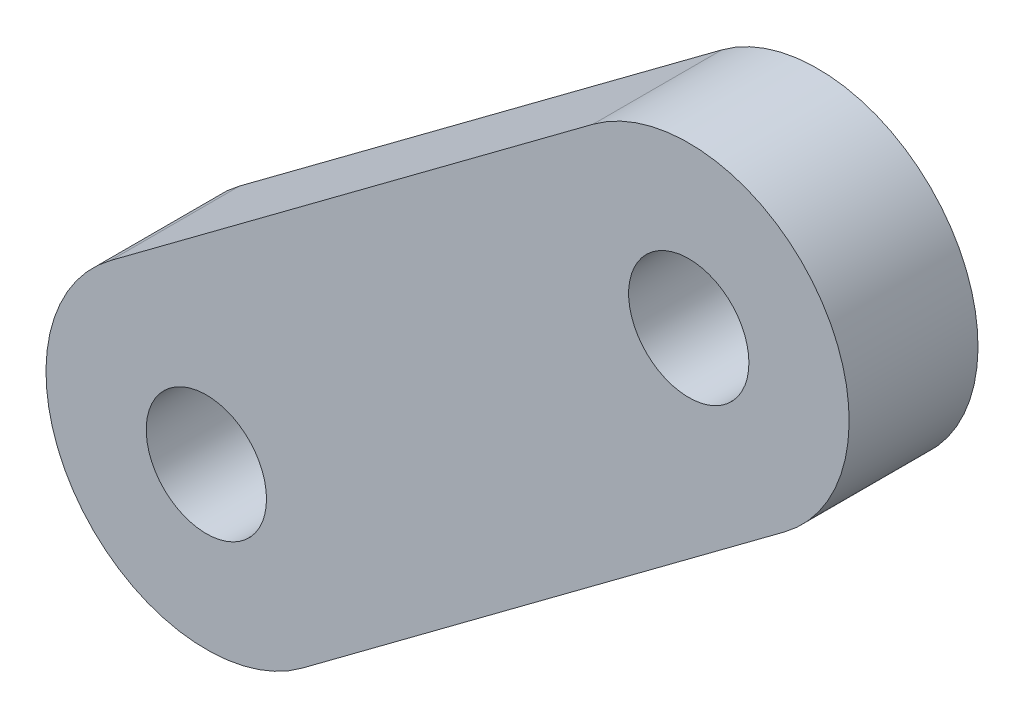
ISO-10303-21;
HEADER;
FILE_DESCRIPTION(('STEP AP214'),'2;1');
FILE_NAME('part.step','',(''),(''),'','','');
FILE_SCHEMA(('AUTOMOTIVE_DESIGN { 1 0 10303 214 1 1 1 1 }'));
ENDSEC;
DATA;
#1=APPLICATION_CONTEXT('core data for automotive mechanical design processes');
#2=APPLICATION_PROTOCOL_DEFINITION('international standard','automotive_design',2000,#1);
#3=PRODUCT_CONTEXT('',#1,'mechanical');
#4=PRODUCT('Part','Part','',(#3));
#5=PRODUCT_RELATED_PRODUCT_CATEGORY('part','',(#4));
#6=PRODUCT_DEFINITION_FORMATION('','',#4);
#7=PRODUCT_DEFINITION_CONTEXT('part definition',#1,'design');
#8=PRODUCT_DEFINITION('design','',#6,#7);
#9=PRODUCT_DEFINITION_SHAPE('','',#8);
#10=(LENGTH_UNIT() NAMED_UNIT(*) SI_UNIT(.MILLI.,.METRE.));
#11=(NAMED_UNIT(*) PLANE_ANGLE_UNIT() SI_UNIT($,.RADIAN.));
#12=(NAMED_UNIT(*) SI_UNIT($,.STERADIAN.) SOLID_ANGLE_UNIT());
#13=UNCERTAINTY_MEASURE_WITH_UNIT(LENGTH_MEASURE(1.E-05),#10,'distance_accuracy_value','');
#14=(GEOMETRIC_REPRESENTATION_CONTEXT(3) GLOBAL_UNCERTAINTY_ASSIGNED_CONTEXT((#13)) GLOBAL_UNIT_ASSIGNED_CONTEXT((#10,
#11,#12)) REPRESENTATION_CONTEXT('',''));
#15=CARTESIAN_POINT('',(0.,0.,0.));
#16=DIRECTION('',(0.,0.,1.));
#17=DIRECTION('',(1.,0.,0.));
#18=AXIS2_PLACEMENT_3D('',#15,#16,#17);
#19=CARTESIAN_POINT('',(6.1931255217864,4.08678242437656,3.));
#20=DIRECTION('',(0.,0.,1.));
#21=DIRECTION('',(1.,0.,0.));
#22=AXIS2_PLACEMENT_3D('',#19,#20,#21);
#23=PLANE('',#22);
#24=CARTESIAN_POINT('',(6.1931255217864,4.08678242437656,3.));
#25=DIRECTION('',(0.,0.,1.));
#26=DIRECTION('',(1.,0.,0.));
#27=AXIS2_PLACEMENT_3D('',#24,#25,#26);
#28=CIRCLE('',#27,1.40000000000001);
#29=CARTESIAN_POINT('',(7.59312552178641,4.08678242437656,3.));
#30=VERTEX_POINT('',#29);
#31=EDGE_CURVE('E118',#30,#30,#28,.T.);
#32=ORIENTED_EDGE('',*,*,#31,.F.);
#33=EDGE_LOOP('',(#32));
#34=FACE_BOUND('',#33,.T.);
#35=CARTESIAN_POINT('',(6.1931255217864,4.08678242437656,3.));
#36=DIRECTION('',(0.,0.,1.));
#37=DIRECTION('',(1.,0.,0.));
#38=AXIS2_PLACEMENT_3D('',#35,#36,#37);
#39=CIRCLE('',#38,3.73333333333334);
#40=CARTESIAN_POINT('',(8.422642560464,1.09228220697398,3.));
#41=VERTEX_POINT('',#40);
#42=CARTESIAN_POINT('',(3.96360848310881,7.08128264177915,3.));
#43=VERTEX_POINT('',#42);
#44=EDGE_CURVE('E98',#41,#43,#39,.T.);
#45=ORIENTED_EDGE('',*,*,#44,.T.);
#46=DIRECTION('',(-0.802098272518547,-0.597192063931498,0.));
#47=VECTOR('',#46,1.);
#48=CARTESIAN_POINT('',(3.96360848310881,7.08128264177915,3.));
#49=LINE('',#48,#47);
#50=CARTESIAN_POINT('',(-7.26576733215088,-1.27940625326184,3.));
#51=VERTEX_POINT('',#50);
#52=EDGE_CURVE('E93',#43,#51,#49,.T.);
#53=ORIENTED_EDGE('',*,*,#52,.T.);
#54=CARTESIAN_POINT('',(-5.03625029347327,-4.27390647066443,3.));
#55=DIRECTION('',(0.,0.,1.));
#56=DIRECTION('',(1.,0.,0.));
#57=AXIS2_PLACEMENT_3D('',#54,#55,#56);
#58=CIRCLE('',#57,3.73333333333334);
#59=CARTESIAN_POINT('',(-2.80673325479568,-7.26840668806701,3.));
#60=VERTEX_POINT('',#59);
#61=EDGE_CURVE('E96',#51,#60,#58,.T.);
#62=ORIENTED_EDGE('',*,*,#61,.T.);
#63=DIRECTION('',(0.802098272518547,0.597192063931498,0.));
#64=VECTOR('',#63,1.);
#65=CARTESIAN_POINT('',(-2.80673325479567,-7.26840668806701,3.));
#66=LINE('',#65,#64);
#67=EDGE_CURVE('E63',#60,#41,#66,.T.);
#68=ORIENTED_EDGE('',*,*,#67,.T.);
#69=EDGE_LOOP('',(#45,#53,#62,#68));
#70=FACE_BOUND('',#69,.T.);
#71=CARTESIAN_POINT('',(-5.03625029347327,-4.27390647066443,3.));
#72=DIRECTION('',(0.,0.,1.));
#73=DIRECTION('',(1.,0.,0.));
#74=AXIS2_PLACEMENT_3D('',#71,#72,#73);
#75=CIRCLE('',#74,1.4);
#76=CARTESIAN_POINT('',(-3.63625029347327,-4.27390647066443,3.));
#77=VERTEX_POINT('',#76);
#78=EDGE_CURVE('E140',#77,#77,#75,.T.);
#79=ORIENTED_EDGE('',*,*,#78,.F.);
#80=EDGE_LOOP('',(#79));
#81=FACE_BOUND('',#80,.T.);
#82=ADVANCED_FACE('F45',(#34,#70,#81),#23,.T.);
#83=CARTESIAN_POINT('',(6.1931255217864,4.08678242437656,0.));
#84=DIRECTION('',(0.,0.,1.));
#85=DIRECTION('',(1.,0.,0.));
#86=AXIS2_PLACEMENT_3D('',#83,#84,#85);
#87=PLANE('',#86);
#88=CARTESIAN_POINT('',(6.1931255217864,4.08678242437656,0.));
#89=DIRECTION('',(0.,0.,1.));
#90=DIRECTION('',(1.,0.,0.));
#91=AXIS2_PLACEMENT_3D('',#88,#89,#90);
#92=CIRCLE('',#91,3.73333333333334);
#93=CARTESIAN_POINT('',(8.422642560464,1.09228220697398,0.));
#94=VERTEX_POINT('',#93);
#95=CARTESIAN_POINT('',(3.96360848310881,7.08128264177915,0.));
#96=VERTEX_POINT('',#95);
#97=EDGE_CURVE('E114',#94,#96,#92,.T.);
#98=ORIENTED_EDGE('',*,*,#97,.F.);
#99=DIRECTION('',(0.802098272518547,0.597192063931498,0.));
#100=VECTOR('',#99,1.);
#101=CARTESIAN_POINT('',(-2.80673325479567,-7.26840668806701,0.));
#102=LINE('',#101,#100);
#103=CARTESIAN_POINT('',(-2.80673325479568,-7.26840668806701,0.));
#104=VERTEX_POINT('',#103);
#105=EDGE_CURVE('E86',#104,#94,#102,.T.);
#106=ORIENTED_EDGE('',*,*,#105,.F.);
#107=CARTESIAN_POINT('',(-5.03625029347327,-4.27390647066443,0.));
#108=DIRECTION('',(0.,0.,1.));
#109=DIRECTION('',(1.,0.,0.));
#110=AXIS2_PLACEMENT_3D('',#107,#108,#109);
#111=CIRCLE('',#110,3.73333333333334);
#112=CARTESIAN_POINT('',(-7.26576733215088,-1.27940625326184,0.));
#113=VERTEX_POINT('',#112);
#114=EDGE_CURVE('E80',#113,#104,#111,.T.);
#115=ORIENTED_EDGE('',*,*,#114,.F.);
#116=DIRECTION('',(-0.802098272518547,-0.597192063931498,0.));
#117=VECTOR('',#116,1.);
#118=CARTESIAN_POINT('',(3.96360848310881,7.08128264177915,0.));
#119=LINE('',#118,#117);
#120=EDGE_CURVE('E103',#96,#113,#119,.T.);
#121=ORIENTED_EDGE('',*,*,#120,.F.);
#122=EDGE_LOOP('',(#98,#106,#115,#121));
#123=FACE_BOUND('',#122,.T.);
#124=CARTESIAN_POINT('',(6.1931255217864,4.08678242437656,0.));
#125=DIRECTION('',(0.,0.,1.));
#126=DIRECTION('',(1.,0.,0.));
#127=AXIS2_PLACEMENT_3D('',#124,#125,#126);
#128=CIRCLE('',#127,1.40000000000001);
#129=CARTESIAN_POINT('',(7.59312552178641,4.08678242437656,0.));
#130=VERTEX_POINT('',#129);
#131=EDGE_CURVE('E136',#130,#130,#128,.T.);
#132=ORIENTED_EDGE('',*,*,#131,.T.);
#133=EDGE_LOOP('',(#132));
#134=FACE_BOUND('',#133,.T.);
#135=CARTESIAN_POINT('',(-5.03625029347327,-4.27390647066443,0.));
#136=DIRECTION('',(0.,0.,1.));
#137=DIRECTION('',(1.,0.,0.));
#138=AXIS2_PLACEMENT_3D('',#135,#136,#137);
#139=CIRCLE('',#138,1.4);
#140=CARTESIAN_POINT('',(-3.63625029347327,-4.27390647066443,0.));
#141=VERTEX_POINT('',#140);
#142=EDGE_CURVE('E144',#141,#141,#139,.T.);
#143=ORIENTED_EDGE('',*,*,#142,.T.);
#144=EDGE_LOOP('',(#143));
#145=FACE_BOUND('',#144,.T.);
#146=ADVANCED_FACE('F131',(#123,#134,#145),#87,.F.);
#147=CARTESIAN_POINT('',(6.1931255217864,4.08678242437656,3.));
#148=DIRECTION('',(0.,0.,-1.));
#149=DIRECTION('',(-1.,0.,0.));
#150=AXIS2_PLACEMENT_3D('',#147,#148,#149);
#151=CYLINDRICAL_SURFACE('',#150,3.73333333333334);
#152=ORIENTED_EDGE('',*,*,#97,.T.);
#153=DIRECTION('',(0.,0.,-1.));
#154=VECTOR('',#153,1.);
#155=CARTESIAN_POINT('',(3.96360848310881,7.08128264177915,3.));
#156=LINE('',#155,#154);
#157=EDGE_CURVE('E11',#43,#96,#156,.T.);
#158=ORIENTED_EDGE('',*,*,#157,.F.);
#159=ORIENTED_EDGE('',*,*,#44,.F.);
#160=DIRECTION('',(0.,0.,-1.));
#161=VECTOR('',#160,1.);
#162=CARTESIAN_POINT('',(8.422642560464,1.09228220697398,3.));
#163=LINE('',#162,#161);
#164=EDGE_CURVE('E110',#41,#94,#163,.T.);
#165=ORIENTED_EDGE('',*,*,#164,.T.);
#166=EDGE_LOOP('',(#152,#158,#159,#165));
#167=FACE_BOUND('',#166,.T.);
#168=ADVANCED_FACE('F47',(#167),#151,.T.);
#169=CARTESIAN_POINT('',(3.96360848310881,7.08128264177915,3.));
#170=DIRECTION('',(0.597192063931498,-0.802098272518547,0.));
#171=DIRECTION('',(0.802098272518547,0.597192063931498,0.));
#172=AXIS2_PLACEMENT_3D('',#169,#170,#171);
#173=PLANE('',#172);
#174=ORIENTED_EDGE('',*,*,#120,.T.);
#175=DIRECTION('',(0.,0.,-1.));
#176=VECTOR('',#175,1.);
#177=CARTESIAN_POINT('',(-7.26576733215088,-1.27940625326184,3.));
#178=LINE('',#177,#176);
#179=EDGE_CURVE('E55',#51,#113,#178,.T.);
#180=ORIENTED_EDGE('',*,*,#179,.F.);
#181=ORIENTED_EDGE('',*,*,#52,.F.);
#182=ORIENTED_EDGE('',*,*,#157,.T.);
#183=EDGE_LOOP('',(#174,#180,#181,#182));
#184=FACE_BOUND('',#183,.T.);
#185=ADVANCED_FACE('F102',(#184),#173,.F.);
#186=CARTESIAN_POINT('',(-5.03625029347327,-4.27390647066443,3.));
#187=DIRECTION('',(0.,0.,-1.));
#188=DIRECTION('',(-1.,0.,0.));
#189=AXIS2_PLACEMENT_3D('',#186,#187,#188);
#190=CYLINDRICAL_SURFACE('',#189,3.73333333333334);
#191=ORIENTED_EDGE('',*,*,#114,.T.);
#192=DIRECTION('',(0.,0.,-1.));
#193=VECTOR('',#192,1.);
#194=CARTESIAN_POINT('',(-2.80673325479568,-7.26840668806701,3.));
#195=LINE('',#194,#193);
#196=EDGE_CURVE('E105',#60,#104,#195,.T.);
#197=ORIENTED_EDGE('',*,*,#196,.F.);
#198=ORIENTED_EDGE('',*,*,#61,.F.);
#199=ORIENTED_EDGE('',*,*,#179,.T.);
#200=EDGE_LOOP('',(#191,#197,#198,#199));
#201=FACE_BOUND('',#200,.T.);
#202=ADVANCED_FACE('F106',(#201),#190,.T.);
#203=CARTESIAN_POINT('',(-2.80673325479567,-7.26840668806701,3.));
#204=DIRECTION('',(-0.597192063931498,0.802098272518547,0.));
#205=DIRECTION('',(-0.802098272518547,-0.597192063931498,0.));
#206=AXIS2_PLACEMENT_3D('',#203,#204,#205);
#207=PLANE('',#206);
#208=ORIENTED_EDGE('',*,*,#105,.T.);
#209=ORIENTED_EDGE('',*,*,#164,.F.);
#210=ORIENTED_EDGE('',*,*,#67,.F.);
#211=ORIENTED_EDGE('',*,*,#196,.T.);
#212=EDGE_LOOP('',(#208,#209,#210,#211));
#213=FACE_BOUND('',#212,.T.);
#214=ADVANCED_FACE('F128',(#213),#207,.F.);
#215=CARTESIAN_POINT('',(6.1931255217864,4.08678242437656,3.));
#216=DIRECTION('',(0.,0.,-1.));
#217=DIRECTION('',(-1.,0.,0.));
#218=AXIS2_PLACEMENT_3D('',#215,#216,#217);
#219=CYLINDRICAL_SURFACE('',#218,1.40000000000001);
#220=ORIENTED_EDGE('',*,*,#31,.T.);
#221=EDGE_LOOP('',(#220));
#222=FACE_BOUND('',#221,.T.);
#223=ORIENTED_EDGE('',*,*,#131,.F.);
#224=EDGE_LOOP('',(#223));
#225=FACE_BOUND('',#224,.T.);
#226=ADVANCED_FACE('F163',(#222,#225),#219,.F.);
#227=CARTESIAN_POINT('',(-5.03625029347327,-4.27390647066443,3.));
#228=DIRECTION('',(0.,0.,-1.));
#229=DIRECTION('',(-1.,0.,0.));
#230=AXIS2_PLACEMENT_3D('',#227,#228,#229);
#231=CYLINDRICAL_SURFACE('',#230,1.4);
#232=ORIENTED_EDGE('',*,*,#78,.T.);
#233=EDGE_LOOP('',(#232));
#234=FACE_BOUND('',#233,.T.);
#235=ORIENTED_EDGE('',*,*,#142,.F.);
#236=EDGE_LOOP('',(#235));
#237=FACE_BOUND('',#236,.T.);
#238=ADVANCED_FACE('F152',(#234,#237),#231,.F.);
#239=CLOSED_SHELL('',(#82,#146,#168,#185,#202,#214,#226,#238));
#240=MANIFOLD_SOLID_BREP('B2',#239);
#241=ADVANCED_BREP_SHAPE_REPRESENTATION('',(#18,#240),#14);
#242=SHAPE_DEFINITION_REPRESENTATION(#9,#241);
ENDSEC;
END-ISO-10303-21;
